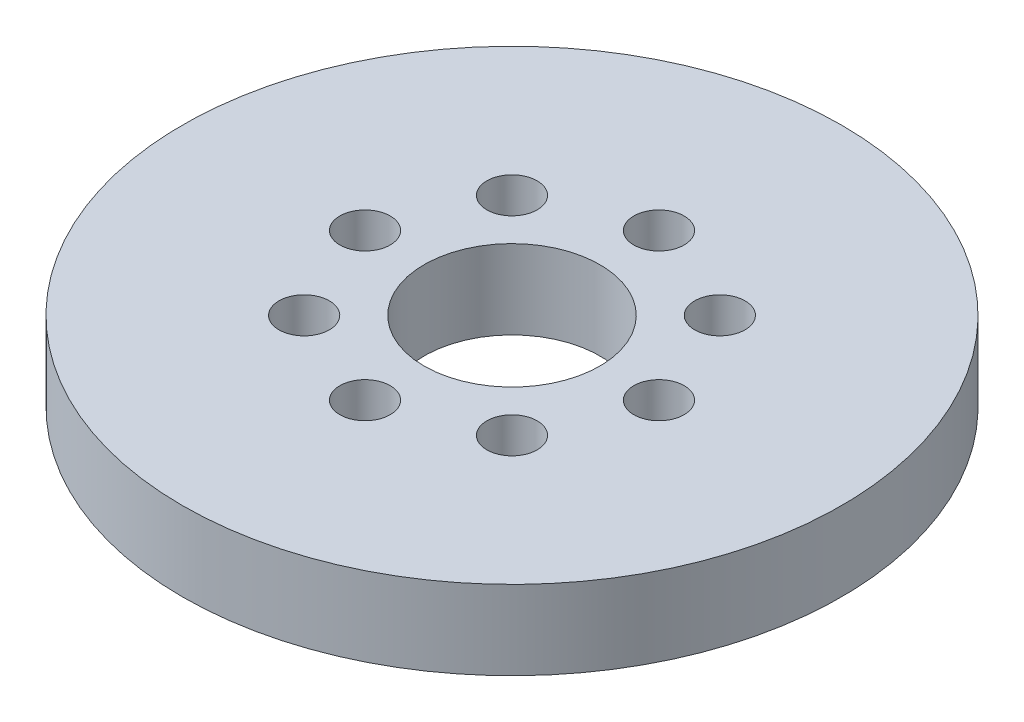
ISO-10303-21;
HEADER;
FILE_DESCRIPTION(('STEP AP214'),'2;1');
FILE_NAME('part.step','',(''),(''),'','','');
FILE_SCHEMA(('AUTOMOTIVE_DESIGN { 1 0 10303 214 1 1 1 1 }'));
ENDSEC;
DATA;
#1=APPLICATION_CONTEXT('core data for automotive mechanical design processes');
#2=APPLICATION_PROTOCOL_DEFINITION('international standard','automotive_design',2000,#1);
#3=PRODUCT_CONTEXT('',#1,'mechanical');
#4=PRODUCT('Part','Part','',(#3));
#5=PRODUCT_RELATED_PRODUCT_CATEGORY('part','',(#4));
#6=PRODUCT_DEFINITION_FORMATION('','',#4);
#7=PRODUCT_DEFINITION_CONTEXT('part definition',#1,'design');
#8=PRODUCT_DEFINITION('design','',#6,#7);
#9=PRODUCT_DEFINITION_SHAPE('','',#8);
#10=(LENGTH_UNIT() NAMED_UNIT(*) SI_UNIT(.MILLI.,.METRE.));
#11=(NAMED_UNIT(*) PLANE_ANGLE_UNIT() SI_UNIT($,.RADIAN.));
#12=(NAMED_UNIT(*) SI_UNIT($,.STERADIAN.) SOLID_ANGLE_UNIT());
#13=UNCERTAINTY_MEASURE_WITH_UNIT(LENGTH_MEASURE(1.E-05),#10,'distance_accuracy_value','');
#14=(GEOMETRIC_REPRESENTATION_CONTEXT(3) GLOBAL_UNCERTAINTY_ASSIGNED_CONTEXT((#13)) GLOBAL_UNIT_ASSIGNED_CONTEXT((#10,
#11,#12)) REPRESENTATION_CONTEXT('',''));
#15=CARTESIAN_POINT('',(0.,0.,0.));
#16=DIRECTION('',(0.,0.,1.));
#17=DIRECTION('',(1.,0.,0.));
#18=AXIS2_PLACEMENT_3D('',#15,#16,#17);
#19=CARTESIAN_POINT('',(0.,18.,0.));
#20=DIRECTION('',(0.,-1.,0.));
#21=DIRECTION('',(0.,0.,-1.));
#22=AXIS2_PLACEMENT_3D('',#19,#20,#21);
#23=CYLINDRICAL_SURFACE('',#22,75.);
#24=CARTESIAN_POINT('',(0.,18.,0.));
#25=DIRECTION('',(0.,1.,0.));
#26=DIRECTION('',(0.,0.,1.));
#27=AXIS2_PLACEMENT_3D('',#24,#25,#26);
#28=CIRCLE('',#27,75.);
#29=CARTESIAN_POINT('',(0.,18.,75.));
#30=VERTEX_POINT('',#29);
#31=EDGE_CURVE('E10',#30,#30,#28,.T.);
#32=ORIENTED_EDGE('',*,*,#31,.F.);
#33=EDGE_LOOP('',(#32));
#34=FACE_BOUND('',#33,.T.);
#35=CARTESIAN_POINT('',(0.,0.,0.));
#36=DIRECTION('',(0.,1.,0.));
#37=DIRECTION('',(0.,0.,1.));
#38=AXIS2_PLACEMENT_3D('',#35,#36,#37);
#39=CIRCLE('',#38,75.);
#40=CARTESIAN_POINT('',(0.,0.,75.));
#41=VERTEX_POINT('',#40);
#42=EDGE_CURVE('E37',#41,#41,#39,.T.);
#43=ORIENTED_EDGE('',*,*,#42,.T.);
#44=EDGE_LOOP('',(#43));
#45=FACE_BOUND('',#44,.T.);
#46=ADVANCED_FACE('F40',(#34,#45),#23,.T.);
#47=CARTESIAN_POINT('',(0.,18.,0.));
#48=DIRECTION('',(0.,1.,0.));
#49=DIRECTION('',(0.,0.,1.));
#50=AXIS2_PLACEMENT_3D('',#47,#48,#49);
#51=PLANE('',#50);
#52=CARTESIAN_POINT('',(1.16781348669049E-13,18.,33.4475076151325));
#53=DIRECTION('',(0.,1.,0.));
#54=DIRECTION('',(1.,0.,0.));
#55=AXIS2_PLACEMENT_3D('',#52,#53,#54);
#56=CIRCLE('',#55,5.73224068014185);
#57=CARTESIAN_POINT('',(5.73224068014196,18.,33.4475076151325));
#58=VERTEX_POINT('',#57);
#59=EDGE_CURVE('E88',#58,#58,#56,.T.);
#60=ORIENTED_EDGE('',*,*,#59,.F.);
#61=EDGE_LOOP('',(#60));
#62=FACE_BOUND('',#61,.T.);
#63=CARTESIAN_POINT('',(23.650959448449,18.,23.6509594484488));
#64=DIRECTION('',(0.,1.,0.));
#65=DIRECTION('',(0.707106781186544,0.,-0.707106781186551));
#66=AXIS2_PLACEMENT_3D('',#63,#64,#65);
#67=CIRCLE('',#66,5.73224068014185);
#68=CARTESIAN_POINT('',(27.7042657047707,18.,19.5976531921271));
#69=VERTEX_POINT('',#68);
#70=EDGE_CURVE('E79',#69,#69,#67,.T.);
#71=ORIENTED_EDGE('',*,*,#70,.F.);
#72=EDGE_LOOP('',(#71));
#73=FACE_BOUND('',#72,.T.);
#74=CARTESIAN_POINT('',(33.4475076151325,18.,0.));
#75=DIRECTION('',(0.,1.,0.));
#76=DIRECTION('',(0.,0.,-1.));
#77=AXIS2_PLACEMENT_3D('',#74,#75,#76);
#78=CIRCLE('',#77,5.73224068014185);
#79=CARTESIAN_POINT('',(33.4475076151325,18.,-5.73224068014185));
#80=VERTEX_POINT('',#79);
#81=EDGE_CURVE('E74',#80,#80,#78,.T.);
#82=ORIENTED_EDGE('',*,*,#81,.F.);
#83=EDGE_LOOP('',(#82));
#84=FACE_BOUND('',#83,.T.);
#85=CARTESIAN_POINT('',(23.6509594484487,18.,-23.6509594484491));
#86=DIRECTION('',(0.,1.,0.));
#87=DIRECTION('',(-0.707106781186554,0.,-0.707106781186541));
#88=AXIS2_PLACEMENT_3D('',#85,#86,#87);
#89=CIRCLE('',#88,5.73224068014185);
#90=CARTESIAN_POINT('',(19.597653192127,18.,-27.7042657047707));
#91=VERTEX_POINT('',#90);
#92=EDGE_CURVE('E70',#91,#91,#89,.T.);
#93=ORIENTED_EDGE('',*,*,#92,.F.);
#94=EDGE_LOOP('',(#93));
#95=FACE_BOUND('',#94,.T.);
#96=CARTESIAN_POINT('',(-3.50344046007146E-13,18.,-33.4475076151325));
#97=DIRECTION('',(0.,1.,0.));
#98=DIRECTION('',(-1.,0.,0.));
#99=AXIS2_PLACEMENT_3D('',#96,#97,#98);
#100=CIRCLE('',#99,5.73224068014185);
#101=CARTESIAN_POINT('',(-5.7322406801422,18.,-33.4475076151324));
#102=VERTEX_POINT('',#101);
#103=EDGE_CURVE('E100',#102,#102,#100,.T.);
#104=ORIENTED_EDGE('',*,*,#103,.F.);
#105=EDGE_LOOP('',(#104));
#106=FACE_BOUND('',#105,.T.);
#107=CARTESIAN_POINT('',(-23.6509594484492,18.,-23.6509594484486));
#108=DIRECTION('',(0.,1.,0.));
#109=DIRECTION('',(-0.707106781186539,0.,0.707106781186556));
#110=AXIS2_PLACEMENT_3D('',#107,#108,#109);
#111=CIRCLE('',#110,5.73224068014185);
#112=CARTESIAN_POINT('',(-27.7042657047708,18.,-19.5976531921269));
#113=VERTEX_POINT('',#112);
#114=EDGE_CURVE('E93',#113,#113,#111,.T.);
#115=ORIENTED_EDGE('',*,*,#114,.F.);
#116=EDGE_LOOP('',(#115));
#117=FACE_BOUND('',#116,.T.);
#118=CARTESIAN_POINT('',(-23.6509594484488,18.,23.6509594484489));
#119=DIRECTION('',(0.,1.,0.));
#120=DIRECTION('',(0.707106781186549,0.,0.707106781186546));
#121=AXIS2_PLACEMENT_3D('',#118,#119,#120);
#122=CIRCLE('',#121,5.73224068014185);
#123=CARTESIAN_POINT('',(-19.5976531921272,18.,27.7042657047706));
#124=VERTEX_POINT('',#123);
#125=EDGE_CURVE('E61',#124,#124,#122,.T.);
#126=ORIENTED_EDGE('',*,*,#125,.F.);
#127=EDGE_LOOP('',(#126));
#128=FACE_BOUND('',#127,.T.);
#129=CARTESIAN_POINT('',(-33.4475076151325,18.,0.));
#130=DIRECTION('',(0.,1.,0.));
#131=DIRECTION('',(0.,0.,1.));
#132=AXIS2_PLACEMENT_3D('',#129,#130,#131);
#133=CIRCLE('',#132,5.73224068014185);
#134=CARTESIAN_POINT('',(-33.4475076151325,18.,5.73224068014185));
#135=VERTEX_POINT('',#134);
#136=EDGE_CURVE('E54',#135,#135,#133,.T.);
#137=ORIENTED_EDGE('',*,*,#136,.F.);
#138=EDGE_LOOP('',(#137));
#139=FACE_BOUND('',#138,.T.);
#140=CARTESIAN_POINT('',(0.,18.,0.));
#141=DIRECTION('',(0.,1.,0.));
#142=DIRECTION('',(0.,0.,1.));
#143=AXIS2_PLACEMENT_3D('',#140,#141,#142);
#144=CIRCLE('',#143,20.);
#145=CARTESIAN_POINT('',(0.,18.,20.));
#146=VERTEX_POINT('',#145);
#147=EDGE_CURVE('E50',#146,#146,#144,.T.);
#148=ORIENTED_EDGE('',*,*,#147,.F.);
#149=EDGE_LOOP('',(#148));
#150=FACE_BOUND('',#149,.T.);
#151=ORIENTED_EDGE('',*,*,#31,.T.);
#152=EDGE_LOOP('',(#151));
#153=FACE_BOUND('',#152,.T.);
#154=ADVANCED_FACE('F115',(#62,#73,#84,#95,#106,#117,#128,#139,#150,#153),#51,.T.);
#155=CARTESIAN_POINT('',(0.,0.,0.));
#156=DIRECTION('',(0.,1.,0.));
#157=DIRECTION('',(0.,0.,1.));
#158=AXIS2_PLACEMENT_3D('',#155,#156,#157);
#159=PLANE('',#158);
#160=CARTESIAN_POINT('',(0.,0.,0.));
#161=DIRECTION('',(0.,1.,0.));
#162=DIRECTION('',(0.,0.,1.));
#163=AXIS2_PLACEMENT_3D('',#160,#161,#162);
#164=CIRCLE('',#163,20.);
#165=CARTESIAN_POINT('',(0.,0.,20.));
#166=VERTEX_POINT('',#165);
#167=EDGE_CURVE('E47',#166,#166,#164,.T.);
#168=ORIENTED_EDGE('',*,*,#167,.T.);
#169=EDGE_LOOP('',(#168));
#170=FACE_BOUND('',#169,.T.);
#171=ORIENTED_EDGE('',*,*,#42,.F.);
#172=EDGE_LOOP('',(#171));
#173=FACE_BOUND('',#172,.T.);
#174=ADVANCED_FACE('F113',(#170,#173),#159,.F.);
#175=CARTESIAN_POINT('',(0.,18.,0.));
#176=DIRECTION('',(0.,-1.,0.));
#177=DIRECTION('',(0.,0.,-1.));
#178=AXIS2_PLACEMENT_3D('',#175,#176,#177);
#179=CYLINDRICAL_SURFACE('',#178,20.);
#180=ORIENTED_EDGE('',*,*,#147,.T.);
#181=EDGE_LOOP('',(#180));
#182=FACE_BOUND('',#181,.T.);
#183=ORIENTED_EDGE('',*,*,#167,.F.);
#184=EDGE_LOOP('',(#183));
#185=FACE_BOUND('',#184,.T.);
#186=ADVANCED_FACE('F127',(#182,#185),#179,.F.);
#187=CARTESIAN_POINT('',(-33.4475076151325,6.51841568339291,0.));
#188=DIRECTION('',(0.,1.,0.));
#189=DIRECTION('',(0.,0.,1.));
#190=AXIS2_PLACEMENT_3D('',#187,#188,#189);
#191=CYLINDRICAL_SURFACE('',#190,5.73224068014185);
#192=CARTESIAN_POINT('',(-33.4475076151325,6.51841568339291,0.));
#193=DIRECTION('',(0.,1.,0.));
#194=DIRECTION('',(0.,0.,1.));
#195=AXIS2_PLACEMENT_3D('',#192,#193,#194);
#196=CIRCLE('',#195,5.73224068014185);
#197=CARTESIAN_POINT('',(-33.4475076151325,6.51841568339291,5.73224068014185));
#198=VERTEX_POINT('',#197);
#199=EDGE_CURVE('E55',#198,#198,#196,.T.);
#200=ORIENTED_EDGE('',*,*,#199,.F.);
#201=EDGE_LOOP('',(#200));
#202=FACE_BOUND('',#201,.T.);
#203=ORIENTED_EDGE('',*,*,#136,.T.);
#204=EDGE_LOOP('',(#203));
#205=FACE_BOUND('',#204,.T.);
#206=ADVANCED_FACE('F129',(#202,#205),#191,.F.);
#207=CARTESIAN_POINT('',(-33.4475076151325,6.51841568339291,0.));
#208=DIRECTION('',(0.,1.,0.));
#209=DIRECTION('',(0.,0.,1.));
#210=AXIS2_PLACEMENT_3D('',#207,#208,#209);
#211=PLANE('',#210);
#212=ORIENTED_EDGE('',*,*,#199,.T.);
#213=EDGE_LOOP('',(#212));
#214=FACE_BOUND('',#213,.T.);
#215=ADVANCED_FACE('F157',(#214),#211,.T.);
#216=CARTESIAN_POINT('',(-23.6509594484488,6.51841568339291,23.6509594484489));
#217=DIRECTION('',(0.,1.,0.));
#218=DIRECTION('',(0.,0.,1.));
#219=AXIS2_PLACEMENT_3D('',#216,#217,#218);
#220=CYLINDRICAL_SURFACE('',#219,5.73224068014185);
#221=CARTESIAN_POINT('',(-23.6509594484488,6.51841568339291,23.6509594484489));
#222=DIRECTION('',(0.,1.,0.));
#223=DIRECTION('',(0.707106781186549,0.,0.707106781186546));
#224=AXIS2_PLACEMENT_3D('',#221,#222,#223);
#225=CIRCLE('',#224,5.73224068014185);
#226=CARTESIAN_POINT('',(-19.5976531921272,6.51841568339291,27.7042657047706));
#227=VERTEX_POINT('',#226);
#228=EDGE_CURVE('E59',#227,#227,#225,.T.);
#229=ORIENTED_EDGE('',*,*,#228,.F.);
#230=EDGE_LOOP('',(#229));
#231=FACE_BOUND('',#230,.T.);
#232=ORIENTED_EDGE('',*,*,#125,.T.);
#233=EDGE_LOOP('',(#232));
#234=FACE_BOUND('',#233,.T.);
#235=ADVANCED_FACE('F170',(#231,#234),#220,.F.);
#236=CARTESIAN_POINT('',(-23.6509594484488,6.51841568339291,23.6509594484489));
#237=DIRECTION('',(0.,1.,0.));
#238=DIRECTION('',(0.707106781186549,0.,0.707106781186546));
#239=AXIS2_PLACEMENT_3D('',#236,#237,#238);
#240=PLANE('',#239);
#241=ORIENTED_EDGE('',*,*,#228,.T.);
#242=EDGE_LOOP('',(#241));
#243=FACE_BOUND('',#242,.T.);
#244=ADVANCED_FACE('F182',(#243),#240,.T.);
#245=CARTESIAN_POINT('',(-23.6509594484492,6.51841568339291,-23.6509594484486));
#246=DIRECTION('',(0.,1.,0.));
#247=DIRECTION('',(0.,0.,1.));
#248=AXIS2_PLACEMENT_3D('',#245,#246,#247);
#249=CYLINDRICAL_SURFACE('',#248,5.73224068014185);
#250=CARTESIAN_POINT('',(-23.6509594484492,6.51841568339291,-23.6509594484486));
#251=DIRECTION('',(0.,1.,0.));
#252=DIRECTION('',(-0.707106781186539,0.,0.707106781186556));
#253=AXIS2_PLACEMENT_3D('',#250,#251,#252);
#254=CIRCLE('',#253,5.73224068014185);
#255=CARTESIAN_POINT('',(-27.7042657047708,6.51841568339291,-19.5976531921269));
#256=VERTEX_POINT('',#255);
#257=EDGE_CURVE('E94',#256,#256,#254,.T.);
#258=ORIENTED_EDGE('',*,*,#257,.F.);
#259=EDGE_LOOP('',(#258));
#260=FACE_BOUND('',#259,.T.);
#261=ORIENTED_EDGE('',*,*,#114,.T.);
#262=EDGE_LOOP('',(#261));
#263=FACE_BOUND('',#262,.T.);
#264=ADVANCED_FACE('F189',(#260,#263),#249,.F.);
#265=CARTESIAN_POINT('',(-23.6509594484492,6.51841568339291,-23.6509594484486));
#266=DIRECTION('',(0.,1.,0.));
#267=DIRECTION('',(-0.707106781186539,0.,0.707106781186556));
#268=AXIS2_PLACEMENT_3D('',#265,#266,#267);
#269=PLANE('',#268);
#270=ORIENTED_EDGE('',*,*,#257,.T.);
#271=EDGE_LOOP('',(#270));
#272=FACE_BOUND('',#271,.T.);
#273=ADVANCED_FACE('F107',(#272),#269,.T.);
#274=CARTESIAN_POINT('',(-3.50344046007146E-13,6.51841568339291,-33.4475076151325));
#275=DIRECTION('',(0.,1.,0.));
#276=DIRECTION('',(0.,0.,1.));
#277=AXIS2_PLACEMENT_3D('',#274,#275,#276);
#278=CYLINDRICAL_SURFACE('',#277,5.73224068014185);
#279=CARTESIAN_POINT('',(-3.50344046007146E-13,6.51841568339291,-33.4475076151325));
#280=DIRECTION('',(0.,1.,0.));
#281=DIRECTION('',(-1.,0.,0.));
#282=AXIS2_PLACEMENT_3D('',#279,#280,#281);
#283=CIRCLE('',#282,5.73224068014185);
#284=CARTESIAN_POINT('',(-5.7322406801422,6.51841568339291,-33.4475076151324));
#285=VERTEX_POINT('',#284);
#286=EDGE_CURVE('E72',#285,#285,#283,.T.);
#287=ORIENTED_EDGE('',*,*,#286,.F.);
#288=EDGE_LOOP('',(#287));
#289=FACE_BOUND('',#288,.T.);
#290=ORIENTED_EDGE('',*,*,#103,.T.);
#291=EDGE_LOOP('',(#290));
#292=FACE_BOUND('',#291,.T.);
#293=ADVANCED_FACE('F104',(#289,#292),#278,.F.);
#294=CARTESIAN_POINT('',(-3.50344046007146E-13,6.51841568339291,-33.4475076151325));
#295=DIRECTION('',(0.,1.,0.));
#296=DIRECTION('',(-1.,0.,0.));
#297=AXIS2_PLACEMENT_3D('',#294,#295,#296);
#298=PLANE('',#297);
#299=ORIENTED_EDGE('',*,*,#286,.T.);
#300=EDGE_LOOP('',(#299));
#301=FACE_BOUND('',#300,.T.);
#302=ADVANCED_FACE('F103',(#301),#298,.T.);
#303=CARTESIAN_POINT('',(23.6509594484487,6.51841568339291,-23.6509594484491));
#304=DIRECTION('',(0.,1.,0.));
#305=DIRECTION('',(0.,0.,1.));
#306=AXIS2_PLACEMENT_3D('',#303,#304,#305);
#307=CYLINDRICAL_SURFACE('',#306,5.73224068014185);
#308=CARTESIAN_POINT('',(23.6509594484487,6.51841568339291,-23.6509594484491));
#309=DIRECTION('',(0.,1.,0.));
#310=DIRECTION('',(-0.707106781186554,0.,-0.707106781186541));
#311=AXIS2_PLACEMENT_3D('',#308,#309,#310);
#312=CIRCLE('',#311,5.73224068014185);
#313=CARTESIAN_POINT('',(19.597653192127,6.51841568339291,-27.7042657047707));
#314=VERTEX_POINT('',#313);
#315=EDGE_CURVE('E69',#314,#314,#312,.T.);
#316=ORIENTED_EDGE('',*,*,#315,.F.);
#317=EDGE_LOOP('',(#316));
#318=FACE_BOUND('',#317,.T.);
#319=ORIENTED_EDGE('',*,*,#92,.T.);
#320=EDGE_LOOP('',(#319));
#321=FACE_BOUND('',#320,.T.);
#322=ADVANCED_FACE('F219',(#318,#321),#307,.F.);
#323=CARTESIAN_POINT('',(23.6509594484487,6.51841568339291,-23.6509594484491));
#324=DIRECTION('',(0.,1.,0.));
#325=DIRECTION('',(-0.707106781186554,0.,-0.707106781186541));
#326=AXIS2_PLACEMENT_3D('',#323,#324,#325);
#327=PLANE('',#326);
#328=ORIENTED_EDGE('',*,*,#315,.T.);
#329=EDGE_LOOP('',(#328));
#330=FACE_BOUND('',#329,.T.);
#331=ADVANCED_FACE('F227',(#330),#327,.T.);
#332=CARTESIAN_POINT('',(33.4475076151325,6.51841568339291,0.));
#333=DIRECTION('',(0.,1.,0.));
#334=DIRECTION('',(0.,0.,1.));
#335=AXIS2_PLACEMENT_3D('',#332,#333,#334);
#336=CYLINDRICAL_SURFACE('',#335,5.73224068014185);
#337=CARTESIAN_POINT('',(33.4475076151325,6.51841568339291,0.));
#338=DIRECTION('',(0.,1.,0.));
#339=DIRECTION('',(0.,0.,-1.));
#340=AXIS2_PLACEMENT_3D('',#337,#338,#339);
#341=CIRCLE('',#340,5.73224068014185);
#342=CARTESIAN_POINT('',(33.4475076151325,6.51841568339291,-5.73224068014185));
#343=VERTEX_POINT('',#342);
#344=EDGE_CURVE('E80',#343,#343,#341,.T.);
#345=ORIENTED_EDGE('',*,*,#344,.F.);
#346=EDGE_LOOP('',(#345));
#347=FACE_BOUND('',#346,.T.);
#348=ORIENTED_EDGE('',*,*,#81,.T.);
#349=EDGE_LOOP('',(#348));
#350=FACE_BOUND('',#349,.T.);
#351=ADVANCED_FACE('F240',(#347,#350),#336,.F.);
#352=CARTESIAN_POINT('',(33.4475076151325,6.51841568339291,0.));
#353=DIRECTION('',(0.,1.,0.));
#354=DIRECTION('',(0.,0.,-1.));
#355=AXIS2_PLACEMENT_3D('',#352,#353,#354);
#356=PLANE('',#355);
#357=ORIENTED_EDGE('',*,*,#344,.T.);
#358=EDGE_LOOP('',(#357));
#359=FACE_BOUND('',#358,.T.);
#360=ADVANCED_FACE('F246',(#359),#356,.T.);
#361=CARTESIAN_POINT('',(23.650959448449,6.51841568339291,23.6509594484488));
#362=DIRECTION('',(0.,1.,0.));
#363=DIRECTION('',(0.,0.,1.));
#364=AXIS2_PLACEMENT_3D('',#361,#362,#363);
#365=CYLINDRICAL_SURFACE('',#364,5.73224068014185);
#366=CARTESIAN_POINT('',(23.650959448449,6.51841568339291,23.6509594484488));
#367=DIRECTION('',(0.,1.,0.));
#368=DIRECTION('',(0.707106781186544,0.,-0.707106781186551));
#369=AXIS2_PLACEMENT_3D('',#366,#367,#368);
#370=CIRCLE('',#369,5.73224068014185);
#371=CARTESIAN_POINT('',(27.7042657047707,6.51841568339291,19.5976531921271));
#372=VERTEX_POINT('',#371);
#373=EDGE_CURVE('E82',#372,#372,#370,.T.);
#374=ORIENTED_EDGE('',*,*,#373,.F.);
#375=EDGE_LOOP('',(#374));
#376=FACE_BOUND('',#375,.T.);
#377=ORIENTED_EDGE('',*,*,#70,.T.);
#378=EDGE_LOOP('',(#377));
#379=FACE_BOUND('',#378,.T.);
#380=ADVANCED_FACE('F254',(#376,#379),#365,.F.);
#381=CARTESIAN_POINT('',(23.650959448449,6.51841568339291,23.6509594484488));
#382=DIRECTION('',(0.,1.,0.));
#383=DIRECTION('',(0.707106781186544,0.,-0.707106781186551));
#384=AXIS2_PLACEMENT_3D('',#381,#382,#383);
#385=PLANE('',#384);
#386=ORIENTED_EDGE('',*,*,#373,.T.);
#387=EDGE_LOOP('',(#386));
#388=FACE_BOUND('',#387,.T.);
#389=ADVANCED_FACE('F262',(#388),#385,.T.);
#390=CARTESIAN_POINT('',(1.16781348669049E-13,6.51841568339291,33.4475076151325));
#391=DIRECTION('',(0.,1.,0.));
#392=DIRECTION('',(0.,0.,1.));
#393=AXIS2_PLACEMENT_3D('',#390,#391,#392);
#394=CYLINDRICAL_SURFACE('',#393,5.73224068014185);
#395=CARTESIAN_POINT('',(1.16781348669049E-13,6.51841568339291,33.4475076151325));
#396=DIRECTION('',(0.,1.,0.));
#397=DIRECTION('',(1.,0.,0.));
#398=AXIS2_PLACEMENT_3D('',#395,#396,#397);
#399=CIRCLE('',#398,5.73224068014185);
#400=CARTESIAN_POINT('',(5.73224068014196,6.51841568339291,33.4475076151325));
#401=VERTEX_POINT('',#400);
#402=EDGE_CURVE('E63',#401,#401,#399,.T.);
#403=ORIENTED_EDGE('',*,*,#402,.F.);
#404=EDGE_LOOP('',(#403));
#405=FACE_BOUND('',#404,.T.);
#406=ORIENTED_EDGE('',*,*,#59,.T.);
#407=EDGE_LOOP('',(#406));
#408=FACE_BOUND('',#407,.T.);
#409=ADVANCED_FACE('F272',(#405,#408),#394,.F.);
#410=CARTESIAN_POINT('',(1.16781348669049E-13,6.51841568339291,33.4475076151325));
#411=DIRECTION('',(0.,1.,0.));
#412=DIRECTION('',(1.,0.,0.));
#413=AXIS2_PLACEMENT_3D('',#410,#411,#412);
#414=PLANE('',#413);
#415=ORIENTED_EDGE('',*,*,#402,.T.);
#416=EDGE_LOOP('',(#415));
#417=FACE_BOUND('',#416,.T.);
#418=ADVANCED_FACE('F285',(#417),#414,.T.);
#419=CLOSED_SHELL('',(#46,#154,#174,#186,#206,#215,#235,#244,#264,#273,#293,#302,#322,#331,#351,
#360,#380,#389,#409,#418));
#420=MANIFOLD_SOLID_BREP('B2',#419);
#421=ADVANCED_BREP_SHAPE_REPRESENTATION('',(#18,#420),#14);
#422=SHAPE_DEFINITION_REPRESENTATION(#9,#421);
ENDSEC;
END-ISO-10303-21;
